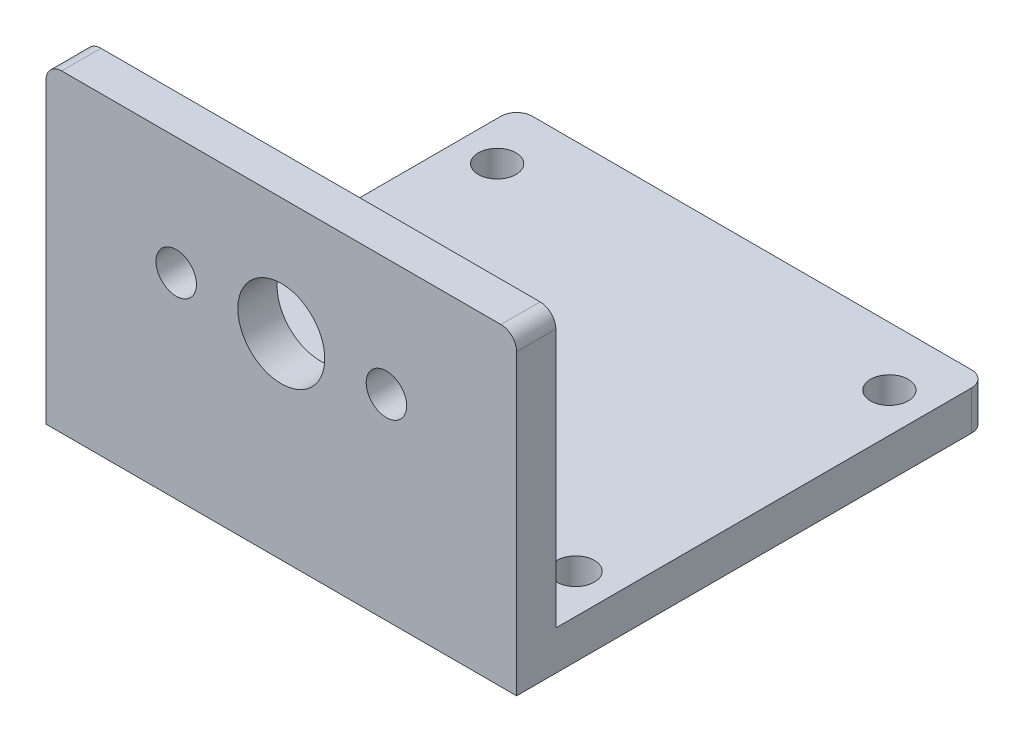
ISO-10303-21;
HEADER;
FILE_DESCRIPTION(('STEP AP214'),'2;1');
FILE_NAME('part.step','',(''),(''),'','','');
FILE_SCHEMA(('AUTOMOTIVE_DESIGN { 1 0 10303 214 1 1 1 1 }'));
ENDSEC;
DATA;
#1=APPLICATION_CONTEXT('core data for automotive mechanical design processes');
#2=APPLICATION_PROTOCOL_DEFINITION('international standard','automotive_design',2000,#1);
#3=PRODUCT_CONTEXT('',#1,'mechanical');
#4=PRODUCT('Part','Part','',(#3));
#5=PRODUCT_RELATED_PRODUCT_CATEGORY('part','',(#4));
#6=PRODUCT_DEFINITION_FORMATION('','',#4);
#7=PRODUCT_DEFINITION_CONTEXT('part definition',#1,'design');
#8=PRODUCT_DEFINITION('design','',#6,#7);
#9=PRODUCT_DEFINITION_SHAPE('','',#8);
#10=(LENGTH_UNIT() NAMED_UNIT(*) SI_UNIT(.MILLI.,.METRE.));
#11=(NAMED_UNIT(*) PLANE_ANGLE_UNIT() SI_UNIT($,.RADIAN.));
#12=(NAMED_UNIT(*) SI_UNIT($,.STERADIAN.) SOLID_ANGLE_UNIT());
#13=UNCERTAINTY_MEASURE_WITH_UNIT(LENGTH_MEASURE(1.E-05),#10,'distance_accuracy_value','');
#14=(GEOMETRIC_REPRESENTATION_CONTEXT(3) GLOBAL_UNCERTAINTY_ASSIGNED_CONTEXT((#13)) GLOBAL_UNIT_ASSIGNED_CONTEXT((#10,
#11,#12)) REPRESENTATION_CONTEXT('',''));
#15=CARTESIAN_POINT('',(0.,0.,0.));
#16=DIRECTION('',(0.,0.,1.));
#17=DIRECTION('',(1.,0.,0.));
#18=AXIS2_PLACEMENT_3D('',#15,#16,#17);
#19=CARTESIAN_POINT('',(38.1,25.4,0.));
#20=DIRECTION('',(0.,0.,-1.));
#21=DIRECTION('',(0.,1.,0.));
#22=AXIS2_PLACEMENT_3D('',#19,#20,#21);
#23=PLANE('',#22);
#24=CARTESIAN_POINT('',(27.559,15.875,0.));
#25=DIRECTION('',(0.,0.,-1.));
#26=DIRECTION('',(-1.,0.,0.));
#27=AXIS2_PLACEMENT_3D('',#24,#25,#26);
#28=CIRCLE('',#27,1.6383);
#29=CARTESIAN_POINT('',(25.9207,15.875,0.));
#30=VERTEX_POINT('',#29);
#31=EDGE_CURVE('E305',#30,#30,#28,.T.);
#32=ORIENTED_EDGE('',*,*,#31,.T.);
#33=EDGE_LOOP('',(#32));
#34=FACE_BOUND('',#33,.T.);
#35=CARTESIAN_POINT('',(10.541,15.875,0.));
#36=DIRECTION('',(0.,0.,-1.));
#37=DIRECTION('',(-1.,0.,0.));
#38=AXIS2_PLACEMENT_3D('',#35,#36,#37);
#39=CIRCLE('',#38,1.6383);
#40=CARTESIAN_POINT('',(8.9027,15.875,0.));
#41=VERTEX_POINT('',#40);
#42=EDGE_CURVE('E310',#41,#41,#39,.T.);
#43=ORIENTED_EDGE('',*,*,#42,.T.);
#44=EDGE_LOOP('',(#43));
#45=FACE_BOUND('',#44,.T.);
#46=CARTESIAN_POINT('',(19.05,15.875,0.));
#47=DIRECTION('',(0.,0.,-1.));
#48=DIRECTION('',(-1.,0.,0.));
#49=AXIS2_PLACEMENT_3D('',#46,#47,#48);
#50=CIRCLE('',#49,3.5179);
#51=CARTESIAN_POINT('',(15.5321,15.875,0.));
#52=VERTEX_POINT('',#51);
#53=EDGE_CURVE('E204',#52,#52,#50,.T.);
#54=ORIENTED_EDGE('',*,*,#53,.T.);
#55=EDGE_LOOP('',(#54));
#56=FACE_BOUND('',#55,.T.);
#57=DIRECTION('',(-1.,0.,0.));
#58=VECTOR('',#57,1.);
#59=CARTESIAN_POINT('',(38.1,25.4,0.));
#60=LINE('',#59,#58);
#61=CARTESIAN_POINT('',(36.83,25.4,0.));
#62=VERTEX_POINT('',#61);
#63=CARTESIAN_POINT('',(1.27000000000001,25.4,0.));
#64=VERTEX_POINT('',#63);
#65=EDGE_CURVE('E179',#62,#64,#60,.T.);
#66=ORIENTED_EDGE('',*,*,#65,.T.);
#67=CARTESIAN_POINT('',(1.27,24.13,0.));
#68=DIRECTION('',(0.,0.,-1.));
#69=DIRECTION('',(0.,1.,0.));
#70=AXIS2_PLACEMENT_3D('',#67,#68,#69);
#71=CIRCLE('',#70,1.27);
#72=CARTESIAN_POINT('',(0.,24.13,0.));
#73=VERTEX_POINT('',#72);
#74=EDGE_CURVE('E169',#64,#73,#71,.F.);
#75=ORIENTED_EDGE('',*,*,#74,.T.);
#76=DIRECTION('',(0.,-1.,0.));
#77=VECTOR('',#76,1.);
#78=CARTESIAN_POINT('',(0.,25.4,0.));
#79=LINE('',#78,#77);
#80=CARTESIAN_POINT('',(0.,0.,0.));
#81=VERTEX_POINT('',#80);
#82=EDGE_CURVE('E135',#73,#81,#79,.T.);
#83=ORIENTED_EDGE('',*,*,#82,.T.);
#84=DIRECTION('',(-1.,0.,0.));
#85=VECTOR('',#84,1.);
#86=CARTESIAN_POINT('',(38.1,0.,0.));
#87=LINE('',#86,#85);
#88=CARTESIAN_POINT('',(38.1,0.,0.));
#89=VERTEX_POINT('',#88);
#90=EDGE_CURVE('E127',#89,#81,#87,.T.);
#91=ORIENTED_EDGE('',*,*,#90,.F.);
#92=DIRECTION('',(0.,-1.,0.));
#93=VECTOR('',#92,1.);
#94=CARTESIAN_POINT('',(38.1,25.4,0.));
#95=LINE('',#94,#93);
#96=CARTESIAN_POINT('',(38.1,24.13,0.));
#97=VERTEX_POINT('',#96);
#98=EDGE_CURVE('E110',#97,#89,#95,.T.);
#99=ORIENTED_EDGE('',*,*,#98,.F.);
#100=CARTESIAN_POINT('',(36.83,24.13,0.));
#101=DIRECTION('',(0.,0.,-1.));
#102=DIRECTION('',(0.,1.,0.));
#103=AXIS2_PLACEMENT_3D('',#100,#101,#102);
#104=CIRCLE('',#103,1.27);
#105=EDGE_CURVE('E167',#97,#62,#104,.F.);
#106=ORIENTED_EDGE('',*,*,#105,.T.);
#107=EDGE_LOOP('',(#66,#75,#83,#91,#99,#106));
#108=FACE_BOUND('',#107,.T.);
#109=ADVANCED_FACE('F32',(#34,#45,#56,#108),#23,.F.);
#110=CARTESIAN_POINT('',(38.1,0.,0.));
#111=DIRECTION('',(0.,1.,0.));
#112=DIRECTION('',(0.,0.,1.));
#113=AXIS2_PLACEMENT_3D('',#110,#111,#112);
#114=PLANE('',#113);
#115=CARTESIAN_POINT('',(34.925,0.,-7.9502));
#116=DIRECTION('',(0.,1.,0.));
#117=DIRECTION('',(0.,0.,1.));
#118=AXIS2_PLACEMENT_3D('',#115,#116,#117);
#119=CIRCLE('',#118,1.524);
#120=CARTESIAN_POINT('',(34.925,0.,-6.42620000000001));
#121=VERTEX_POINT('',#120);
#122=EDGE_CURVE('E279',#121,#121,#119,.T.);
#123=ORIENTED_EDGE('',*,*,#122,.T.);
#124=EDGE_LOOP('',(#123));
#125=FACE_BOUND('',#124,.T.);
#126=CARTESIAN_POINT('',(34.925,0.,-33.3502));
#127=DIRECTION('',(0.,1.,0.));
#128=DIRECTION('',(0.,0.,1.));
#129=AXIS2_PLACEMENT_3D('',#126,#127,#128);
#130=CIRCLE('',#129,1.524);
#131=CARTESIAN_POINT('',(34.925,0.,-31.8262));
#132=VERTEX_POINT('',#131);
#133=EDGE_CURVE('E287',#132,#132,#130,.T.);
#134=ORIENTED_EDGE('',*,*,#133,.T.);
#135=EDGE_LOOP('',(#134));
#136=FACE_BOUND('',#135,.T.);
#137=CARTESIAN_POINT('',(3.175,0.,-33.3502));
#138=DIRECTION('',(0.,1.,0.));
#139=DIRECTION('',(0.,0.,1.));
#140=AXIS2_PLACEMENT_3D('',#137,#138,#139);
#141=CIRCLE('',#140,1.524);
#142=CARTESIAN_POINT('',(3.175,0.,-31.8262));
#143=VERTEX_POINT('',#142);
#144=EDGE_CURVE('E293',#143,#143,#141,.T.);
#145=ORIENTED_EDGE('',*,*,#144,.T.);
#146=EDGE_LOOP('',(#145));
#147=FACE_BOUND('',#146,.T.);
#148=CARTESIAN_POINT('',(3.175,0.,-7.9502));
#149=DIRECTION('',(0.,1.,0.));
#150=DIRECTION('',(0.,0.,1.));
#151=AXIS2_PLACEMENT_3D('',#148,#149,#150);
#152=CIRCLE('',#151,1.524);
#153=CARTESIAN_POINT('',(3.175,0.,-6.4262));
#154=VERTEX_POINT('',#153);
#155=EDGE_CURVE('E299',#154,#154,#152,.T.);
#156=ORIENTED_EDGE('',*,*,#155,.T.);
#157=EDGE_LOOP('',(#156));
#158=FACE_BOUND('',#157,.T.);
#159=DIRECTION('',(0.,0.,-1.));
#160=VECTOR('',#159,1.);
#161=CARTESIAN_POINT('',(0.,0.,0.));
#162=LINE('',#161,#160);
#163=CARTESIAN_POINT('',(0.,0.,-36.83));
#164=VERTEX_POINT('',#163);
#165=EDGE_CURVE('E203',#81,#164,#162,.T.);
#166=ORIENTED_EDGE('',*,*,#165,.T.);
#167=CARTESIAN_POINT('',(1.27,0.,-36.83));
#168=DIRECTION('',(0.,1.,0.));
#169=DIRECTION('',(0.,0.,1.));
#170=AXIS2_PLACEMENT_3D('',#167,#168,#169);
#171=CIRCLE('',#170,1.27);
#172=CARTESIAN_POINT('',(1.27000000000001,0.,-38.1));
#173=VERTEX_POINT('',#172);
#174=EDGE_CURVE('E158',#164,#173,#171,.F.);
#175=ORIENTED_EDGE('',*,*,#174,.T.);
#176=DIRECTION('',(-1.,0.,0.));
#177=VECTOR('',#176,1.);
#178=CARTESIAN_POINT('',(38.1,0.,-38.1));
#179=LINE('',#178,#177);
#180=CARTESIAN_POINT('',(36.83,0.,-38.1));
#181=VERTEX_POINT('',#180);
#182=EDGE_CURVE('E138',#181,#173,#179,.T.);
#183=ORIENTED_EDGE('',*,*,#182,.F.);
#184=CARTESIAN_POINT('',(36.83,0.,-36.83));
#185=DIRECTION('',(0.,1.,0.));
#186=DIRECTION('',(0.,0.,1.));
#187=AXIS2_PLACEMENT_3D('',#184,#185,#186);
#188=CIRCLE('',#187,1.27);
#189=CARTESIAN_POINT('',(38.1,0.,-36.83));
#190=VERTEX_POINT('',#189);
#191=EDGE_CURVE('E130',#181,#190,#188,.F.);
#192=ORIENTED_EDGE('',*,*,#191,.T.);
#193=DIRECTION('',(0.,0.,-1.));
#194=VECTOR('',#193,1.);
#195=CARTESIAN_POINT('',(38.1,0.,0.));
#196=LINE('',#195,#194);
#197=EDGE_CURVE('E114',#89,#190,#196,.T.);
#198=ORIENTED_EDGE('',*,*,#197,.F.);
#199=ORIENTED_EDGE('',*,*,#90,.T.);
#200=EDGE_LOOP('',(#166,#175,#183,#192,#198,#199));
#201=FACE_BOUND('',#200,.T.);
#202=ADVANCED_FACE('F126',(#125,#136,#147,#158,#201),#114,.F.);
#203=CARTESIAN_POINT('',(38.1,0.,-38.1));
#204=DIRECTION('',(0.,0.,1.));
#205=DIRECTION('',(1.,0.,0.));
#206=AXIS2_PLACEMENT_3D('',#203,#204,#205);
#207=PLANE('',#206);
#208=ORIENTED_EDGE('',*,*,#182,.T.);
#209=DIRECTION('',(0.,1.,0.));
#210=VECTOR('',#209,1.);
#211=CARTESIAN_POINT('',(1.27,0.,-38.1));
#212=LINE('',#211,#210);
#213=CARTESIAN_POINT('',(1.27000000000001,3.175,-38.1));
#214=VERTEX_POINT('',#213);
#215=EDGE_CURVE('E140',#173,#214,#212,.T.);
#216=ORIENTED_EDGE('',*,*,#215,.T.);
#217=DIRECTION('',(-1.,0.,0.));
#218=VECTOR('',#217,1.);
#219=CARTESIAN_POINT('',(38.1,3.175,-38.1));
#220=LINE('',#219,#218);
#221=CARTESIAN_POINT('',(36.83,3.175,-38.1));
#222=VERTEX_POINT('',#221);
#223=EDGE_CURVE('E143',#222,#214,#220,.T.);
#224=ORIENTED_EDGE('',*,*,#223,.F.);
#225=DIRECTION('',(0.,1.,0.));
#226=VECTOR('',#225,1.);
#227=CARTESIAN_POINT('',(36.83,0.,-38.1));
#228=LINE('',#227,#226);
#229=EDGE_CURVE('E137',#222,#181,#228,.F.);
#230=ORIENTED_EDGE('',*,*,#229,.T.);
#231=EDGE_LOOP('',(#208,#216,#224,#230));
#232=FACE_BOUND('',#231,.T.);
#233=ADVANCED_FACE('F196',(#232),#207,.F.);
#234=CARTESIAN_POINT('',(38.1,3.175,-38.1));
#235=DIRECTION('',(0.,-1.,0.));
#236=DIRECTION('',(0.,0.,-1.));
#237=AXIS2_PLACEMENT_3D('',#234,#235,#236);
#238=PLANE('',#237);
#239=CARTESIAN_POINT('',(34.925,3.175,-7.9502));
#240=DIRECTION('',(0.,1.,0.));
#241=DIRECTION('',(0.,0.,1.));
#242=AXIS2_PLACEMENT_3D('',#239,#240,#241);
#243=CIRCLE('',#242,1.524);
#244=CARTESIAN_POINT('',(34.925,3.175,-6.42620000000001));
#245=VERTEX_POINT('',#244);
#246=EDGE_CURVE('E282',#245,#245,#243,.T.);
#247=ORIENTED_EDGE('',*,*,#246,.F.);
#248=EDGE_LOOP('',(#247));
#249=FACE_BOUND('',#248,.T.);
#250=CARTESIAN_POINT('',(34.925,3.175,-33.3502));
#251=DIRECTION('',(0.,1.,0.));
#252=DIRECTION('',(0.,0.,1.));
#253=AXIS2_PLACEMENT_3D('',#250,#251,#252);
#254=CIRCLE('',#253,1.524);
#255=CARTESIAN_POINT('',(34.925,3.175,-31.8262));
#256=VERTEX_POINT('',#255);
#257=EDGE_CURVE('E284',#256,#256,#254,.T.);
#258=ORIENTED_EDGE('',*,*,#257,.F.);
#259=EDGE_LOOP('',(#258));
#260=FACE_BOUND('',#259,.T.);
#261=CARTESIAN_POINT('',(3.175,3.175,-33.3502));
#262=DIRECTION('',(0.,1.,0.));
#263=DIRECTION('',(0.,0.,1.));
#264=AXIS2_PLACEMENT_3D('',#261,#262,#263);
#265=CIRCLE('',#264,1.524);
#266=CARTESIAN_POINT('',(3.175,3.175,-31.8262));
#267=VERTEX_POINT('',#266);
#268=EDGE_CURVE('E290',#267,#267,#265,.T.);
#269=ORIENTED_EDGE('',*,*,#268,.F.);
#270=EDGE_LOOP('',(#269));
#271=FACE_BOUND('',#270,.T.);
#272=CARTESIAN_POINT('',(3.175,3.175,-7.9502));
#273=DIRECTION('',(0.,1.,0.));
#274=DIRECTION('',(0.,0.,1.));
#275=AXIS2_PLACEMENT_3D('',#272,#273,#274);
#276=CIRCLE('',#275,1.524);
#277=CARTESIAN_POINT('',(3.175,3.175,-6.4262));
#278=VERTEX_POINT('',#277);
#279=EDGE_CURVE('E296',#278,#278,#276,.T.);
#280=ORIENTED_EDGE('',*,*,#279,.F.);
#281=EDGE_LOOP('',(#280));
#282=FACE_BOUND('',#281,.T.);
#283=ORIENTED_EDGE('',*,*,#223,.T.);
#284=CARTESIAN_POINT('',(1.27,3.175,-36.83));
#285=DIRECTION('',(0.,-1.,0.));
#286=DIRECTION('',(0.,0.,-1.));
#287=AXIS2_PLACEMENT_3D('',#284,#285,#286);
#288=CIRCLE('',#287,1.27);
#289=CARTESIAN_POINT('',(0.,3.175,-36.83));
#290=VERTEX_POINT('',#289);
#291=EDGE_CURVE('E151',#214,#290,#288,.F.);
#292=ORIENTED_EDGE('',*,*,#291,.T.);
#293=DIRECTION('',(0.,0.,1.));
#294=VECTOR('',#293,1.);
#295=CARTESIAN_POINT('',(0.,3.175,-38.1));
#296=LINE('',#295,#294);
#297=CARTESIAN_POINT('',(0.,3.175,-3.175));
#298=VERTEX_POINT('',#297);
#299=EDGE_CURVE('E205',#290,#298,#296,.T.);
#300=ORIENTED_EDGE('',*,*,#299,.T.);
#301=DIRECTION('',(-1.,0.,0.));
#302=VECTOR('',#301,1.);
#303=CARTESIAN_POINT('',(38.1,3.175,-3.175));
#304=LINE('',#303,#302);
#305=CARTESIAN_POINT('',(38.1,3.175,-3.175));
#306=VERTEX_POINT('',#305);
#307=EDGE_CURVE('E184',#306,#298,#304,.T.);
#308=ORIENTED_EDGE('',*,*,#307,.F.);
#309=DIRECTION('',(0.,0.,1.));
#310=VECTOR('',#309,1.);
#311=CARTESIAN_POINT('',(38.1,3.175,-38.1));
#312=LINE('',#311,#310);
#313=CARTESIAN_POINT('',(38.1,3.175,-36.83));
#314=VERTEX_POINT('',#313);
#315=EDGE_CURVE('E131',#314,#306,#312,.T.);
#316=ORIENTED_EDGE('',*,*,#315,.F.);
#317=CARTESIAN_POINT('',(36.83,3.175,-36.83));
#318=DIRECTION('',(0.,-1.,0.));
#319=DIRECTION('',(0.,0.,-1.));
#320=AXIS2_PLACEMENT_3D('',#317,#318,#319);
#321=CIRCLE('',#320,1.27);
#322=EDGE_CURVE('E149',#314,#222,#321,.F.);
#323=ORIENTED_EDGE('',*,*,#322,.T.);
#324=EDGE_LOOP('',(#283,#292,#300,#308,#316,#323));
#325=FACE_BOUND('',#324,.T.);
#326=ADVANCED_FACE('F192',(#249,#260,#271,#282,#325),#238,.F.);
#327=CARTESIAN_POINT('',(38.1,3.175,-3.175));
#328=DIRECTION('',(0.,0.,1.));
#329=DIRECTION('',(1.,0.,0.));
#330=AXIS2_PLACEMENT_3D('',#327,#328,#329);
#331=PLANE('',#330);
#332=CARTESIAN_POINT('',(27.559,15.875,-3.175));
#333=DIRECTION('',(0.,0.,-1.));
#334=DIRECTION('',(-1.,0.,0.));
#335=AXIS2_PLACEMENT_3D('',#332,#333,#334);
#336=CIRCLE('',#335,1.6383);
#337=CARTESIAN_POINT('',(25.9207,15.875,-3.175));
#338=VERTEX_POINT('',#337);
#339=EDGE_CURVE('E302',#338,#338,#336,.T.);
#340=ORIENTED_EDGE('',*,*,#339,.F.);
#341=EDGE_LOOP('',(#340));
#342=FACE_BOUND('',#341,.T.);
#343=CARTESIAN_POINT('',(10.541,15.875,-3.175));
#344=DIRECTION('',(0.,0.,-1.));
#345=DIRECTION('',(-1.,0.,0.));
#346=AXIS2_PLACEMENT_3D('',#343,#344,#345);
#347=CIRCLE('',#346,1.6383);
#348=CARTESIAN_POINT('',(8.9027,15.875,-3.175));
#349=VERTEX_POINT('',#348);
#350=EDGE_CURVE('E307',#349,#349,#347,.T.);
#351=ORIENTED_EDGE('',*,*,#350,.F.);
#352=EDGE_LOOP('',(#351));
#353=FACE_BOUND('',#352,.T.);
#354=CARTESIAN_POINT('',(19.05,15.875,-3.175));
#355=DIRECTION('',(0.,0.,-1.));
#356=DIRECTION('',(-1.,0.,0.));
#357=AXIS2_PLACEMENT_3D('',#354,#355,#356);
#358=CIRCLE('',#357,3.5179);
#359=CARTESIAN_POINT('',(15.5321,15.875,-3.175));
#360=VERTEX_POINT('',#359);
#361=EDGE_CURVE('E313',#360,#360,#358,.T.);
#362=ORIENTED_EDGE('',*,*,#361,.F.);
#363=EDGE_LOOP('',(#362));
#364=FACE_BOUND('',#363,.T.);
#365=DIRECTION('',(0.,1.,0.));
#366=VECTOR('',#365,1.);
#367=CARTESIAN_POINT('',(0.,3.175,-3.175));
#368=LINE('',#367,#366);
#369=CARTESIAN_POINT('',(0.,24.13,-3.175));
#370=VERTEX_POINT('',#369);
#371=EDGE_CURVE('E121',#298,#370,#368,.T.);
#372=ORIENTED_EDGE('',*,*,#371,.T.);
#373=CARTESIAN_POINT('',(1.27,24.13,-3.175));
#374=DIRECTION('',(0.,0.,1.));
#375=DIRECTION('',(1.,0.,0.));
#376=AXIS2_PLACEMENT_3D('',#373,#374,#375);
#377=CIRCLE('',#376,1.27);
#378=CARTESIAN_POINT('',(1.27000000000001,25.4,-3.175));
#379=VERTEX_POINT('',#378);
#380=EDGE_CURVE('E11',#370,#379,#377,.F.);
#381=ORIENTED_EDGE('',*,*,#380,.T.);
#382=DIRECTION('',(-1.,0.,0.));
#383=VECTOR('',#382,1.);
#384=CARTESIAN_POINT('',(38.1,25.4,-3.175));
#385=LINE('',#384,#383);
#386=CARTESIAN_POINT('',(36.83,25.4,-3.175));
#387=VERTEX_POINT('',#386);
#388=EDGE_CURVE('E175',#387,#379,#385,.T.);
#389=ORIENTED_EDGE('',*,*,#388,.F.);
#390=CARTESIAN_POINT('',(36.83,24.13,-3.175));
#391=DIRECTION('',(0.,0.,1.));
#392=DIRECTION('',(1.,0.,0.));
#393=AXIS2_PLACEMENT_3D('',#390,#391,#392);
#394=CIRCLE('',#393,1.27);
#395=CARTESIAN_POINT('',(38.1,24.13,-3.175));
#396=VERTEX_POINT('',#395);
#397=EDGE_CURVE('E40',#387,#396,#394,.F.);
#398=ORIENTED_EDGE('',*,*,#397,.T.);
#399=DIRECTION('',(0.,1.,0.));
#400=VECTOR('',#399,1.);
#401=CARTESIAN_POINT('',(38.1,3.175,-3.175));
#402=LINE('',#401,#400);
#403=EDGE_CURVE('E174',#306,#396,#402,.T.);
#404=ORIENTED_EDGE('',*,*,#403,.F.);
#405=ORIENTED_EDGE('',*,*,#307,.T.);
#406=EDGE_LOOP('',(#372,#381,#389,#398,#404,#405));
#407=FACE_BOUND('',#406,.T.);
#408=ADVANCED_FACE('F172',(#342,#353,#364,#407),#331,.F.);
#409=CARTESIAN_POINT('',(38.1,25.4,-3.175));
#410=DIRECTION('',(0.,-1.,0.));
#411=DIRECTION('',(0.,0.,-1.));
#412=AXIS2_PLACEMENT_3D('',#409,#410,#411);
#413=PLANE('',#412);
#414=ORIENTED_EDGE('',*,*,#388,.T.);
#415=DIRECTION('',(0.,0.,1.));
#416=VECTOR('',#415,1.);
#417=CARTESIAN_POINT('',(1.27,25.4,-3.175));
#418=LINE('',#417,#416);
#419=EDGE_CURVE('E164',#379,#64,#418,.T.);
#420=ORIENTED_EDGE('',*,*,#419,.T.);
#421=ORIENTED_EDGE('',*,*,#65,.F.);
#422=DIRECTION('',(0.,0.,1.));
#423=VECTOR('',#422,1.);
#424=CARTESIAN_POINT('',(36.83,25.4,-3.175));
#425=LINE('',#424,#423);
#426=EDGE_CURVE('E52',#62,#387,#425,.F.);
#427=ORIENTED_EDGE('',*,*,#426,.T.);
#428=EDGE_LOOP('',(#414,#420,#421,#427));
#429=FACE_BOUND('',#428,.T.);
#430=ADVANCED_FACE('F181',(#429),#413,.F.);
#431=CARTESIAN_POINT('',(38.1,0.,0.));
#432=DIRECTION('',(1.,0.,0.));
#433=DIRECTION('',(0.,0.,-1.));
#434=AXIS2_PLACEMENT_3D('',#431,#432,#433);
#435=PLANE('',#434);
#436=ORIENTED_EDGE('',*,*,#197,.T.);
#437=DIRECTION('',(0.,1.,0.));
#438=VECTOR('',#437,1.);
#439=CARTESIAN_POINT('',(38.1,3.175,-36.83));
#440=LINE('',#439,#438);
#441=EDGE_CURVE('E161',#190,#314,#440,.T.);
#442=ORIENTED_EDGE('',*,*,#441,.T.);
#443=ORIENTED_EDGE('',*,*,#315,.T.);
#444=ORIENTED_EDGE('',*,*,#403,.T.);
#445=DIRECTION('',(0.,0.,1.));
#446=VECTOR('',#445,1.);
#447=CARTESIAN_POINT('',(38.1,24.13,0.));
#448=LINE('',#447,#446);
#449=EDGE_CURVE('E118',#396,#97,#448,.T.);
#450=ORIENTED_EDGE('',*,*,#449,.T.);
#451=ORIENTED_EDGE('',*,*,#98,.T.);
#452=EDGE_LOOP('',(#436,#442,#443,#444,#450,#451));
#453=FACE_BOUND('',#452,.T.);
#454=ADVANCED_FACE('F112',(#453),#435,.T.);
#455=CARTESIAN_POINT('',(0.,0.,0.));
#456=DIRECTION('',(1.,0.,0.));
#457=DIRECTION('',(0.,0.,-1.));
#458=AXIS2_PLACEMENT_3D('',#455,#456,#457);
#459=PLANE('',#458);
#460=ORIENTED_EDGE('',*,*,#299,.F.);
#461=DIRECTION('',(0.,1.,0.));
#462=VECTOR('',#461,1.);
#463=CARTESIAN_POINT('',(0.,0.,-36.83));
#464=LINE('',#463,#462);
#465=EDGE_CURVE('E155',#290,#164,#464,.F.);
#466=ORIENTED_EDGE('',*,*,#465,.T.);
#467=ORIENTED_EDGE('',*,*,#165,.F.);
#468=ORIENTED_EDGE('',*,*,#82,.F.);
#469=DIRECTION('',(0.,0.,1.));
#470=VECTOR('',#469,1.);
#471=CARTESIAN_POINT('',(0.,24.13,0.));
#472=LINE('',#471,#470);
#473=EDGE_CURVE('E153',#73,#370,#472,.F.);
#474=ORIENTED_EDGE('',*,*,#473,.T.);
#475=ORIENTED_EDGE('',*,*,#371,.F.);
#476=EDGE_LOOP('',(#460,#466,#467,#468,#474,#475));
#477=FACE_BOUND('',#476,.T.);
#478=ADVANCED_FACE('F211',(#477),#459,.F.);
#479=CARTESIAN_POINT('',(19.05,15.875,0.));
#480=DIRECTION('',(0.,0.,-1.));
#481=DIRECTION('',(-1.,0.,0.));
#482=AXIS2_PLACEMENT_3D('',#479,#480,#481);
#483=CYLINDRICAL_SURFACE('',#482,3.5179);
#484=ORIENTED_EDGE('',*,*,#53,.F.);
#485=EDGE_LOOP('',(#484));
#486=FACE_BOUND('',#485,.T.);
#487=ORIENTED_EDGE('',*,*,#361,.T.);
#488=EDGE_LOOP('',(#487));
#489=FACE_BOUND('',#488,.T.);
#490=ADVANCED_FACE('F250',(#486,#489),#483,.F.);
#491=CARTESIAN_POINT('',(10.541,15.875,0.));
#492=DIRECTION('',(0.,0.,-1.));
#493=DIRECTION('',(-1.,0.,0.));
#494=AXIS2_PLACEMENT_3D('',#491,#492,#493);
#495=CYLINDRICAL_SURFACE('',#494,1.6383);
#496=ORIENTED_EDGE('',*,*,#42,.F.);
#497=EDGE_LOOP('',(#496));
#498=FACE_BOUND('',#497,.T.);
#499=ORIENTED_EDGE('',*,*,#350,.T.);
#500=EDGE_LOOP('',(#499));
#501=FACE_BOUND('',#500,.T.);
#502=ADVANCED_FACE('F224',(#498,#501),#495,.F.);
#503=CARTESIAN_POINT('',(27.559,15.875,0.));
#504=DIRECTION('',(0.,0.,-1.));
#505=DIRECTION('',(-1.,0.,0.));
#506=AXIS2_PLACEMENT_3D('',#503,#504,#505);
#507=CYLINDRICAL_SURFACE('',#506,1.6383);
#508=ORIENTED_EDGE('',*,*,#31,.F.);
#509=EDGE_LOOP('',(#508));
#510=FACE_BOUND('',#509,.T.);
#511=ORIENTED_EDGE('',*,*,#339,.T.);
#512=EDGE_LOOP('',(#511));
#513=FACE_BOUND('',#512,.T.);
#514=ADVANCED_FACE('F217',(#510,#513),#507,.F.);
#515=CARTESIAN_POINT('',(1.27,0.,-36.83));
#516=DIRECTION('',(0.,1.,0.));
#517=DIRECTION('',(0.,0.,1.));
#518=AXIS2_PLACEMENT_3D('',#515,#516,#517);
#519=CYLINDRICAL_SURFACE('',#518,1.27);
#520=ORIENTED_EDGE('',*,*,#174,.F.);
#521=ORIENTED_EDGE('',*,*,#465,.F.);
#522=ORIENTED_EDGE('',*,*,#291,.F.);
#523=ORIENTED_EDGE('',*,*,#215,.F.);
#524=EDGE_LOOP('',(#520,#521,#522,#523));
#525=FACE_BOUND('',#524,.T.);
#526=ADVANCED_FACE('F215',(#525),#519,.T.);
#527=CARTESIAN_POINT('',(36.83,0.,-36.83));
#528=DIRECTION('',(0.,-1.,0.));
#529=DIRECTION('',(0.,0.,-1.));
#530=AXIS2_PLACEMENT_3D('',#527,#528,#529);
#531=CYLINDRICAL_SURFACE('',#530,1.27);
#532=ORIENTED_EDGE('',*,*,#191,.F.);
#533=ORIENTED_EDGE('',*,*,#229,.F.);
#534=ORIENTED_EDGE('',*,*,#322,.F.);
#535=ORIENTED_EDGE('',*,*,#441,.F.);
#536=EDGE_LOOP('',(#532,#533,#534,#535));
#537=FACE_BOUND('',#536,.T.);
#538=ADVANCED_FACE('F199',(#537),#531,.T.);
#539=CARTESIAN_POINT('',(1.27,24.13,-3.175));
#540=DIRECTION('',(0.,0.,1.));
#541=DIRECTION('',(1.,0.,0.));
#542=AXIS2_PLACEMENT_3D('',#539,#540,#541);
#543=CYLINDRICAL_SURFACE('',#542,1.27);
#544=ORIENTED_EDGE('',*,*,#380,.F.);
#545=ORIENTED_EDGE('',*,*,#473,.F.);
#546=ORIENTED_EDGE('',*,*,#74,.F.);
#547=ORIENTED_EDGE('',*,*,#419,.F.);
#548=EDGE_LOOP('',(#544,#545,#546,#547));
#549=FACE_BOUND('',#548,.T.);
#550=ADVANCED_FACE('F210',(#549),#543,.T.);
#551=CARTESIAN_POINT('',(36.83,24.13,0.));
#552=DIRECTION('',(0.,0.,-1.));
#553=DIRECTION('',(-1.,0.,0.));
#554=AXIS2_PLACEMENT_3D('',#551,#552,#553);
#555=CYLINDRICAL_SURFACE('',#554,1.27);
#556=ORIENTED_EDGE('',*,*,#397,.F.);
#557=ORIENTED_EDGE('',*,*,#426,.F.);
#558=ORIENTED_EDGE('',*,*,#105,.F.);
#559=ORIENTED_EDGE('',*,*,#449,.F.);
#560=EDGE_LOOP('',(#556,#557,#558,#559));
#561=FACE_BOUND('',#560,.T.);
#562=ADVANCED_FACE('F34',(#561),#555,.T.);
#563=CARTESIAN_POINT('',(3.175,0.,-7.9502));
#564=DIRECTION('',(0.,1.,0.));
#565=DIRECTION('',(0.,0.,1.));
#566=AXIS2_PLACEMENT_3D('',#563,#564,#565);
#567=CYLINDRICAL_SURFACE('',#566,1.524);
#568=ORIENTED_EDGE('',*,*,#155,.F.);
#569=EDGE_LOOP('',(#568));
#570=FACE_BOUND('',#569,.T.);
#571=ORIENTED_EDGE('',*,*,#279,.T.);
#572=EDGE_LOOP('',(#571));
#573=FACE_BOUND('',#572,.T.);
#574=ADVANCED_FACE('F259',(#570,#573),#567,.F.);
#575=CARTESIAN_POINT('',(3.175,0.,-33.3502));
#576=DIRECTION('',(0.,1.,0.));
#577=DIRECTION('',(0.,0.,1.));
#578=AXIS2_PLACEMENT_3D('',#575,#576,#577);
#579=CYLINDRICAL_SURFACE('',#578,1.524);
#580=ORIENTED_EDGE('',*,*,#144,.F.);
#581=EDGE_LOOP('',(#580));
#582=FACE_BOUND('',#581,.T.);
#583=ORIENTED_EDGE('',*,*,#268,.T.);
#584=EDGE_LOOP('',(#583));
#585=FACE_BOUND('',#584,.T.);
#586=ADVANCED_FACE('F262',(#582,#585),#579,.F.);
#587=CARTESIAN_POINT('',(34.925,0.,-33.3502));
#588=DIRECTION('',(0.,1.,0.));
#589=DIRECTION('',(0.,0.,1.));
#590=AXIS2_PLACEMENT_3D('',#587,#588,#589);
#591=CYLINDRICAL_SURFACE('',#590,1.524);
#592=ORIENTED_EDGE('',*,*,#133,.F.);
#593=EDGE_LOOP('',(#592));
#594=FACE_BOUND('',#593,.T.);
#595=ORIENTED_EDGE('',*,*,#257,.T.);
#596=EDGE_LOOP('',(#595));
#597=FACE_BOUND('',#596,.T.);
#598=ADVANCED_FACE('F266',(#594,#597),#591,.F.);
#599=CARTESIAN_POINT('',(34.925,0.,-7.9502));
#600=DIRECTION('',(0.,1.,0.));
#601=DIRECTION('',(0.,0.,1.));
#602=AXIS2_PLACEMENT_3D('',#599,#600,#601);
#603=CYLINDRICAL_SURFACE('',#602,1.524);
#604=ORIENTED_EDGE('',*,*,#122,.F.);
#605=EDGE_LOOP('',(#604));
#606=FACE_BOUND('',#605,.T.);
#607=ORIENTED_EDGE('',*,*,#246,.T.);
#608=EDGE_LOOP('',(#607));
#609=FACE_BOUND('',#608,.T.);
#610=ADVANCED_FACE('F270',(#606,#609),#603,.F.);
#611=CLOSED_SHELL('',(#109,#202,#233,#326,#408,#430,#454,#478,#490,#502,#514,#526,#538,#550,
#562,#574,#586,#598,#610));
#612=MANIFOLD_SOLID_BREP('B2',#611);
#613=ADVANCED_BREP_SHAPE_REPRESENTATION('',(#18,#612),#14);
#614=SHAPE_DEFINITION_REPRESENTATION(#9,#613);
ENDSEC;
END-ISO-10303-21;
